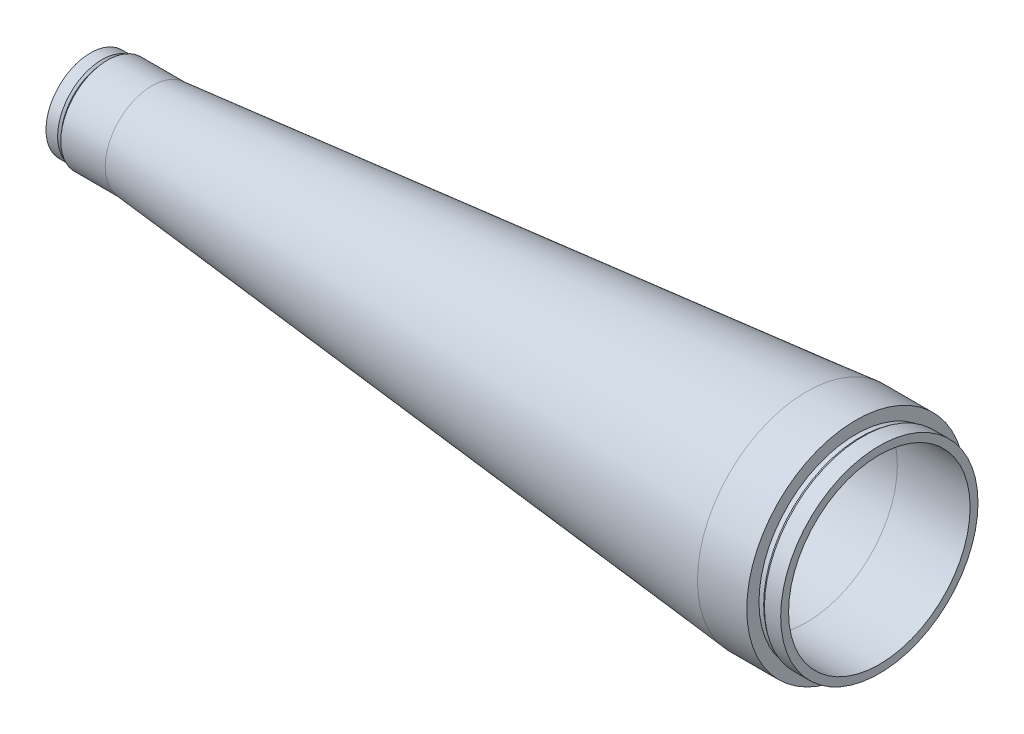
ISO-10303-21;
HEADER;
FILE_DESCRIPTION(('STEP AP214'),'2;1');
FILE_NAME('part.step','',(''),(''),'','','');
FILE_SCHEMA(('AUTOMOTIVE_DESIGN { 1 0 10303 214 1 1 1 1 }'));
ENDSEC;
DATA;
#1=APPLICATION_CONTEXT('core data for automotive mechanical design processes');
#2=APPLICATION_PROTOCOL_DEFINITION('international standard','automotive_design',2000,#1);
#3=PRODUCT_CONTEXT('',#1,'mechanical');
#4=PRODUCT('Part','Part','',(#3));
#5=PRODUCT_RELATED_PRODUCT_CATEGORY('part','',(#4));
#6=PRODUCT_DEFINITION_FORMATION('','',#4);
#7=PRODUCT_DEFINITION_CONTEXT('part definition',#1,'design');
#8=PRODUCT_DEFINITION('design','',#6,#7);
#9=PRODUCT_DEFINITION_SHAPE('','',#8);
#10=(LENGTH_UNIT() NAMED_UNIT(*) SI_UNIT(.MILLI.,.METRE.));
#11=(NAMED_UNIT(*) PLANE_ANGLE_UNIT() SI_UNIT($,.RADIAN.));
#12=(NAMED_UNIT(*) SI_UNIT($,.STERADIAN.) SOLID_ANGLE_UNIT());
#13=UNCERTAINTY_MEASURE_WITH_UNIT(LENGTH_MEASURE(1.E-05),#10,'distance_accuracy_value','');
#14=(GEOMETRIC_REPRESENTATION_CONTEXT(3) GLOBAL_UNCERTAINTY_ASSIGNED_CONTEXT((#13)) GLOBAL_UNIT_ASSIGNED_CONTEXT((#10,
#11,#12)) REPRESENTATION_CONTEXT('',''));
#15=CARTESIAN_POINT('',(0.,0.,0.));
#16=DIRECTION('',(0.,0.,1.));
#17=DIRECTION('',(1.,0.,0.));
#18=AXIS2_PLACEMENT_3D('',#15,#16,#17);
#19=CARTESIAN_POINT('',(-212.632233047034,3.9118014383277E-13,0.));
#20=DIRECTION('',(-1.,0.,0.));
#21=DIRECTION('',(0.,0.,1.));
#22=AXIS2_PLACEMENT_3D('',#19,#20,#21);
#23=CONICAL_SURFACE('',#22,25.5999999999999,0.785398163397451);
#24=CARTESIAN_POINT('',(-213.932233047034,3.97251675998689E-13,0.));
#25=DIRECTION('',(-1.,0.,0.));
#26=DIRECTION('',(0.,0.,1.));
#27=AXIS2_PLACEMENT_3D('',#24,#25,#26);
#28=CIRCLE('',#27,26.8999999999999);
#29=CARTESIAN_POINT('',(-213.932233047034,4.104567986034E-13,26.8999999999999));
#30=VERTEX_POINT('',#29);
#31=EDGE_CURVE('E10',#30,#30,#28,.T.);
#32=ORIENTED_EDGE('',*,*,#31,.T.);
#33=EDGE_LOOP('',(#32));
#34=FACE_BOUND('',#33,.T.);
#35=CARTESIAN_POINT('',(-212.632233047034,3.9118014383277E-13,0.));
#36=DIRECTION('',(-1.,0.,0.));
#37=DIRECTION('',(0.,0.,1.));
#38=AXIS2_PLACEMENT_3D('',#35,#36,#37);
#39=CIRCLE('',#38,25.5999999999999);
#40=CARTESIAN_POINT('',(-212.632233047034,4.03747100661046E-13,25.5999999999999));
#41=VERTEX_POINT('',#40);
#42=EDGE_CURVE('E137',#41,#41,#39,.T.);
#43=ORIENTED_EDGE('',*,*,#42,.F.);
#44=EDGE_LOOP('',(#43));
#45=FACE_BOUND('',#44,.T.);
#46=ADVANCED_FACE('F34',(#34,#45),#23,.F.);
#47=CARTESIAN_POINT('',(-172.442437000996,2.70616862252382E-13,0.));
#48=DIRECTION('',(-1.,0.,0.));
#49=DIRECTION('',(0.,0.,1.));
#50=AXIS2_PLACEMENT_3D('',#47,#48,#49);
#51=CYLINDRICAL_SURFACE('',#50,26.8999999999999);
#52=CARTESIAN_POINT('',(-215.550000000001,3.9118014383277E-13,0.));
#53=DIRECTION('',(-1.,0.,0.));
#54=DIRECTION('',(0.,0.,1.));
#55=AXIS2_PLACEMENT_3D('',#52,#53,#54);
#56=CIRCLE('',#55,26.9);
#57=CARTESIAN_POINT('',(-215.550000000001,4.04385266437482E-13,26.9));
#58=VERTEX_POINT('',#57);
#59=EDGE_CURVE('E40',#58,#58,#56,.T.);
#60=ORIENTED_EDGE('',*,*,#59,.T.);
#61=EDGE_LOOP('',(#60));
#62=FACE_BOUND('',#61,.T.);
#63=ORIENTED_EDGE('',*,*,#31,.F.);
#64=EDGE_LOOP('',(#63));
#65=FACE_BOUND('',#64,.T.);
#66=ADVANCED_FACE('F145',(#62,#65),#51,.F.);
#67=CARTESIAN_POINT('',(-215.550000000001,-25.3999999999997,0.));
#68=DIRECTION('',(1.,0.,0.));
#69=DIRECTION('',(0.,0.,-1.));
#70=AXIS2_PLACEMENT_3D('',#67,#68,#69);
#71=PLANE('',#70);
#72=CARTESIAN_POINT('',(-215.550000000001,3.73832909073002E-13,0.));
#73=DIRECTION('',(-1.,0.,0.));
#74=DIRECTION('',(0.,0.,1.));
#75=AXIS2_PLACEMENT_3D('',#72,#73,#74);
#76=CIRCLE('',#75,25.4);
#77=CARTESIAN_POINT('',(-215.550000000001,3.86301686551057E-13,25.4));
#78=VERTEX_POINT('',#77);
#79=EDGE_CURVE('E44',#78,#78,#76,.T.);
#80=ORIENTED_EDGE('',*,*,#79,.T.);
#81=EDGE_LOOP('',(#80));
#82=FACE_BOUND('',#81,.T.);
#83=ORIENTED_EDGE('',*,*,#59,.F.);
#84=EDGE_LOOP('',(#83));
#85=FACE_BOUND('',#84,.T.);
#86=ADVANCED_FACE('F149',(#82,#85),#71,.T.);
#87=CARTESIAN_POINT('',(-172.442437000996,2.70616862252382E-13,0.));
#88=DIRECTION('',(-1.,0.,0.));
#89=DIRECTION('',(0.,0.,1.));
#90=AXIS2_PLACEMENT_3D('',#87,#88,#89);
#91=CYLINDRICAL_SURFACE('',#90,25.4);
#92=CARTESIAN_POINT('',(-217.050000000001,3.93782229046735E-13,0.));
#93=DIRECTION('',(-1.,0.,0.));
#94=DIRECTION('',(0.,0.,1.));
#95=AXIS2_PLACEMENT_3D('',#92,#93,#94);
#96=CIRCLE('',#95,25.4);
#97=CARTESIAN_POINT('',(-217.050000000001,4.0625100652479E-13,25.4));
#98=VERTEX_POINT('',#97);
#99=EDGE_CURVE('E48',#98,#98,#96,.T.);
#100=ORIENTED_EDGE('',*,*,#99,.T.);
#101=EDGE_LOOP('',(#100));
#102=FACE_BOUND('',#101,.T.);
#103=ORIENTED_EDGE('',*,*,#79,.F.);
#104=EDGE_LOOP('',(#103));
#105=FACE_BOUND('',#104,.T.);
#106=ADVANCED_FACE('F153',(#102,#105),#91,.F.);
#107=CARTESIAN_POINT('',(-217.050000000001,-23.3999999999997,0.));
#108=DIRECTION('',(1.,0.,0.));
#109=DIRECTION('',(0.,0.,-1.));
#110=AXIS2_PLACEMENT_3D('',#107,#108,#109);
#111=PLANE('',#110);
#112=CARTESIAN_POINT('',(-217.050000000001,3.88578058618805E-13,0.));
#113=DIRECTION('',(-1.,0.,0.));
#114=DIRECTION('',(0.,0.,1.));
#115=AXIS2_PLACEMENT_3D('',#112,#113,#114);
#116=CIRCLE('',#115,23.4);
#117=CARTESIAN_POINT('',(-217.050000000001,4.00065042594651E-13,23.4));
#118=VERTEX_POINT('',#117);
#119=EDGE_CURVE('E53',#118,#118,#116,.T.);
#120=ORIENTED_EDGE('',*,*,#119,.T.);
#121=EDGE_LOOP('',(#120));
#122=FACE_BOUND('',#121,.T.);
#123=ORIENTED_EDGE('',*,*,#99,.F.);
#124=EDGE_LOOP('',(#123));
#125=FACE_BOUND('',#124,.T.);
#126=ADVANCED_FACE('F160',(#122,#125),#111,.T.);
#127=CARTESIAN_POINT('',(-217.050000000001,3.88578058618805E-13,0.));
#128=DIRECTION('',(1.,0.,0.));
#129=DIRECTION('',(0.,0.,-1.));
#130=AXIS2_PLACEMENT_3D('',#127,#128,#129);
#131=CONICAL_SURFACE('',#130,23.4,0.099668652491162);
#132=CARTESIAN_POINT('',(-322.050000000001,6.17561557447743E-13,0.));
#133=DIRECTION('',(-1.,0.,0.));
#134=DIRECTION('',(0.,0.,1.));
#135=AXIS2_PLACEMENT_3D('',#132,#133,#134);
#136=CIRCLE('',#135,12.9);
#137=CARTESIAN_POINT('',(-322.050000000001,6.23894125536992E-13,12.9));
#138=VERTEX_POINT('',#137);
#139=EDGE_CURVE('E56',#138,#138,#136,.T.);
#140=ORIENTED_EDGE('',*,*,#139,.T.);
#141=EDGE_LOOP('',(#140));
#142=FACE_BOUND('',#141,.T.);
#143=ORIENTED_EDGE('',*,*,#119,.F.);
#144=EDGE_LOOP('',(#143));
#145=FACE_BOUND('',#144,.T.);
#146=ADVANCED_FACE('F164',(#142,#145),#131,.F.);
#147=CARTESIAN_POINT('',(-322.050000000001,-12.8999999999994,1.70258369571177E-13));
#148=DIRECTION('',(-1.,0.,0.));
#149=DIRECTION('',(0.,0.,1.));
#150=AXIS2_PLACEMENT_3D('',#147,#148,#149);
#151=PLANE('',#150);
#152=CARTESIAN_POINT('',(-322.050000000001,6.17561557447743E-13,0.));
#153=DIRECTION('',(-1.,0.,0.));
#154=DIRECTION('',(0.,0.,1.));
#155=AXIS2_PLACEMENT_3D('',#152,#153,#154);
#156=CIRCLE('',#155,15.4);
#157=CARTESIAN_POINT('',(-322.050000000001,6.25121367414753E-13,15.4));
#158=VERTEX_POINT('',#157);
#159=EDGE_CURVE('E59',#158,#158,#156,.T.);
#160=ORIENTED_EDGE('',*,*,#159,.T.);
#161=EDGE_LOOP('',(#160));
#162=FACE_BOUND('',#161,.T.);
#163=ORIENTED_EDGE('',*,*,#139,.F.);
#164=EDGE_LOOP('',(#163));
#165=FACE_BOUND('',#164,.T.);
#166=ADVANCED_FACE('F168',(#162,#165),#151,.T.);
#167=CARTESIAN_POINT('',(-172.442437000996,2.70616862252382E-13,0.));
#168=DIRECTION('',(-1.,0.,0.));
#169=DIRECTION('',(0.,0.,1.));
#170=AXIS2_PLACEMENT_3D('',#167,#168,#169);
#171=CYLINDRICAL_SURFACE('',#170,15.4);
#172=CARTESIAN_POINT('',(-323.750000000001,7.07767178198537E-13,1.01576182852826E-13));
#173=DIRECTION('',(-1.,0.,0.));
#174=DIRECTION('',(0.,0.,1.));
#175=AXIS2_PLACEMENT_3D('',#172,#173,#174);
#176=CIRCLE('',#175,15.4);
#177=CARTESIAN_POINT('',(-323.750000000001,7.15326988165547E-13,15.4000000000001));
#178=VERTEX_POINT('',#177);
#179=EDGE_CURVE('E62',#178,#178,#176,.T.);
#180=ORIENTED_EDGE('',*,*,#179,.T.);
#181=EDGE_LOOP('',(#180));
#182=FACE_BOUND('',#181,.T.);
#183=ORIENTED_EDGE('',*,*,#159,.F.);
#184=EDGE_LOOP('',(#183));
#185=FACE_BOUND('',#184,.T.);
#186=ADVANCED_FACE('F172',(#182,#185),#171,.F.);
#187=CARTESIAN_POINT('',(-323.750000000001,-15.3999999999994,0.));
#188=DIRECTION('',(-1.,0.,0.));
#189=DIRECTION('',(0.,0.,1.));
#190=AXIS2_PLACEMENT_3D('',#187,#188,#189);
#191=PLANE('',#190);
#192=CARTESIAN_POINT('',(-323.750000000001,7.07767178198537E-13,1.01576182852826E-13));
#193=DIRECTION('',(-1.,0.,0.));
#194=DIRECTION('',(0.,0.,1.));
#195=AXIS2_PLACEMENT_3D('',#192,#193,#194);
#196=CIRCLE('',#195,16.5);
#197=CARTESIAN_POINT('',(-323.750000000001,7.15866974591762E-13,16.5000000000001));
#198=VERTEX_POINT('',#197);
#199=EDGE_CURVE('E65',#198,#198,#196,.T.);
#200=ORIENTED_EDGE('',*,*,#199,.T.);
#201=EDGE_LOOP('',(#200));
#202=FACE_BOUND('',#201,.T.);
#203=ORIENTED_EDGE('',*,*,#179,.F.);
#204=EDGE_LOOP('',(#203));
#205=FACE_BOUND('',#204,.T.);
#206=ADVANCED_FACE('F176',(#202,#205),#191,.T.);
#207=CARTESIAN_POINT('',(-172.442437000996,2.70616862252382E-13,0.));
#208=DIRECTION('',(-1.,0.,0.));
#209=DIRECTION('',(0.,0.,1.));
#210=AXIS2_PLACEMENT_3D('',#207,#208,#209);
#211=CYLINDRICAL_SURFACE('',#210,16.4999999999999);
#212=CARTESIAN_POINT('',(-324.964213562374,6.45317133063372E-13,0.));
#213=DIRECTION('',(-1.,0.,0.));
#214=DIRECTION('',(0.,0.,1.));
#215=AXIS2_PLACEMENT_3D('',#212,#213,#214);
#216=CIRCLE('',#215,16.4999999999999);
#217=CARTESIAN_POINT('',(-324.964213562374,6.53416929456597E-13,16.4999999999999));
#218=VERTEX_POINT('',#217);
#219=EDGE_CURVE('E68',#218,#218,#216,.T.);
#220=ORIENTED_EDGE('',*,*,#219,.T.);
#221=EDGE_LOOP('',(#220));
#222=FACE_BOUND('',#221,.T.);
#223=ORIENTED_EDGE('',*,*,#199,.F.);
#224=EDGE_LOOP('',(#223));
#225=FACE_BOUND('',#224,.T.);
#226=ADVANCED_FACE('F180',(#222,#225),#211,.F.);
#227=CARTESIAN_POINT('',(-324.964213562374,6.45317133063372E-13,0.));
#228=DIRECTION('',(1.,0.,0.));
#229=DIRECTION('',(0.,0.,-1.));
#230=AXIS2_PLACEMENT_3D('',#227,#228,#229);
#231=CONICAL_SURFACE('',#230,16.4999999999999,0.785398163397393);
#232=CARTESIAN_POINT('',(-325.964213562374,6.59194920871187E-13,0.));
#233=DIRECTION('',(-1.,0.,0.));
#234=DIRECTION('',(0.,0.,1.));
#235=AXIS2_PLACEMENT_3D('',#232,#233,#234);
#236=CIRCLE('',#235,15.4999999999999);
#237=CARTESIAN_POINT('',(-325.964213562374,6.66803820513307E-13,15.4999999999999));
#238=VERTEX_POINT('',#237);
#239=EDGE_CURVE('E71',#238,#238,#236,.T.);
#240=ORIENTED_EDGE('',*,*,#239,.T.);
#241=EDGE_LOOP('',(#240));
#242=FACE_BOUND('',#241,.T.);
#243=ORIENTED_EDGE('',*,*,#219,.F.);
#244=EDGE_LOOP('',(#243));
#245=FACE_BOUND('',#244,.T.);
#246=ADVANCED_FACE('F184',(#242,#245),#231,.F.);
#247=CARTESIAN_POINT('',(-172.442437000996,2.70616862252382E-13,0.));
#248=DIRECTION('',(-1.,0.,0.));
#249=DIRECTION('',(0.,0.,1.));
#250=AXIS2_PLACEMENT_3D('',#247,#248,#249);
#251=CYLINDRICAL_SURFACE('',#250,15.5);
#252=CARTESIAN_POINT('',(-347.050000000001,7.07767178198537E-13,0.));
#253=DIRECTION('',(-1.,0.,0.));
#254=DIRECTION('',(0.,0.,1.));
#255=AXIS2_PLACEMENT_3D('',#252,#253,#254);
#256=CIRCLE('',#255,15.5);
#257=CARTESIAN_POINT('',(-347.050000000001,7.15376077840657E-13,15.5000000000001));
#258=VERTEX_POINT('',#257);
#259=EDGE_CURVE('E74',#258,#258,#256,.T.);
#260=ORIENTED_EDGE('',*,*,#259,.T.);
#261=EDGE_LOOP('',(#260));
#262=FACE_BOUND('',#261,.T.);
#263=ORIENTED_EDGE('',*,*,#239,.F.);
#264=EDGE_LOOP('',(#263));
#265=FACE_BOUND('',#264,.T.);
#266=ADVANCED_FACE('F188',(#262,#265),#251,.F.);
#267=CARTESIAN_POINT('',(-347.050000000001,-15.4999999999993,1.01617053864882E-13));
#268=DIRECTION('',(-1.,0.,0.));
#269=DIRECTION('',(0.,0.,1.));
#270=AXIS2_PLACEMENT_3D('',#267,#268,#269);
#271=PLANE('',#270);
#272=CARTESIAN_POINT('',(-347.050000000001,7.07767178198537E-13,0.));
#273=DIRECTION('',(-1.,0.,0.));
#274=DIRECTION('',(0.,0.,1.));
#275=AXIS2_PLACEMENT_3D('',#272,#273,#274);
#276=CIRCLE('',#275,18.);
#277=CARTESIAN_POINT('',(-347.050000000001,7.16603319718419E-13,18.0000000000001));
#278=VERTEX_POINT('',#277);
#279=EDGE_CURVE('E77',#278,#278,#276,.T.);
#280=ORIENTED_EDGE('',*,*,#279,.T.);
#281=EDGE_LOOP('',(#280));
#282=FACE_BOUND('',#281,.T.);
#283=ORIENTED_EDGE('',*,*,#259,.F.);
#284=EDGE_LOOP('',(#283));
#285=FACE_BOUND('',#284,.T.);
#286=ADVANCED_FACE('F192',(#282,#285),#271,.T.);
#287=CARTESIAN_POINT('',(-172.442437000996,2.70616862252382E-13,0.));
#288=DIRECTION('',(-1.,0.,0.));
#289=DIRECTION('',(0.,0.,1.));
#290=AXIS2_PLACEMENT_3D('',#287,#288,#289);
#291=CYLINDRICAL_SURFACE('',#290,18.);
#292=CARTESIAN_POINT('',(-342.350000000001,6.52256026967279E-13,0.));
#293=DIRECTION('',(-1.,0.,0.));
#294=DIRECTION('',(0.,0.,1.));
#295=AXIS2_PLACEMENT_3D('',#292,#293,#294);
#296=CIRCLE('',#295,18.);
#297=CARTESIAN_POINT('',(-342.350000000001,6.61092168487161E-13,18.));
#298=VERTEX_POINT('',#297);
#299=EDGE_CURVE('E80',#298,#298,#296,.T.);
#300=ORIENTED_EDGE('',*,*,#299,.T.);
#301=EDGE_LOOP('',(#300));
#302=FACE_BOUND('',#301,.T.);
#303=ORIENTED_EDGE('',*,*,#279,.F.);
#304=EDGE_LOOP('',(#303));
#305=FACE_BOUND('',#304,.T.);
#306=ADVANCED_FACE('F196',(#302,#305),#291,.T.);
#307=CARTESIAN_POINT('',(-342.350000000001,6.52256026967279E-13,0.));
#308=DIRECTION('',(-1.,0.,0.));
#309=DIRECTION('',(0.,0.,1.));
#310=AXIS2_PLACEMENT_3D('',#307,#308,#309);
#311=CONICAL_SURFACE('',#310,18.,0.718829999621615);
#312=CARTESIAN_POINT('',(-341.550000000001,7.35522753814166E-13,1.09140238163424E-13));
#313=DIRECTION('',(-1.,0.,0.));
#314=DIRECTION('',(0.,0.,1.));
#315=AXIS2_PLACEMENT_3D('',#312,#313,#314);
#316=CIRCLE('',#315,17.3);
#317=CARTESIAN_POINT('',(-341.550000000001,7.44015267608274E-13,17.3000000000001));
#318=VERTEX_POINT('',#317);
#319=EDGE_CURVE('E83',#318,#318,#316,.T.);
#320=ORIENTED_EDGE('',*,*,#319,.T.);
#321=EDGE_LOOP('',(#320));
#322=FACE_BOUND('',#321,.T.);
#323=ORIENTED_EDGE('',*,*,#299,.F.);
#324=EDGE_LOOP('',(#323));
#325=FACE_BOUND('',#324,.T.);
#326=ADVANCED_FACE('F200',(#322,#325),#311,.T.);
#327=CARTESIAN_POINT('',(-172.442437000996,2.70616862252382E-13,0.));
#328=DIRECTION('',(-1.,0.,0.));
#329=DIRECTION('',(0.,0.,1.));
#330=AXIS2_PLACEMENT_3D('',#327,#328,#329);
#331=CYLINDRICAL_SURFACE('',#330,17.3);
#332=CARTESIAN_POINT('',(-340.050000000001,6.52256026967279E-13,0.));
#333=DIRECTION('',(-1.,0.,0.));
#334=DIRECTION('',(0.,0.,1.));
#335=AXIS2_PLACEMENT_3D('',#332,#333,#334);
#336=CIRCLE('',#335,17.3);
#337=CARTESIAN_POINT('',(-340.050000000001,6.60748540761388E-13,17.3000000000001));
#338=VERTEX_POINT('',#337);
#339=EDGE_CURVE('E86',#338,#338,#336,.T.);
#340=ORIENTED_EDGE('',*,*,#339,.T.);
#341=EDGE_LOOP('',(#340));
#342=FACE_BOUND('',#341,.T.);
#343=ORIENTED_EDGE('',*,*,#319,.F.);
#344=EDGE_LOOP('',(#343));
#345=FACE_BOUND('',#344,.T.);
#346=ADVANCED_FACE('F204',(#342,#345),#331,.T.);
#347=CARTESIAN_POINT('',(-340.050000000001,-18.9999999999993,0.));
#348=DIRECTION('',(-1.,0.,0.));
#349=DIRECTION('',(0.,0.,1.));
#350=AXIS2_PLACEMENT_3D('',#347,#348,#349);
#351=PLANE('',#350);
#352=CARTESIAN_POINT('',(-340.050000000001,6.52256026967279E-13,0.));
#353=DIRECTION('',(-1.,0.,0.));
#354=DIRECTION('',(0.,0.,1.));
#355=AXIS2_PLACEMENT_3D('',#352,#353,#354);
#356=CIRCLE('',#355,18.9999999999999);
#357=CARTESIAN_POINT('',(-340.050000000001,6.61583065238265E-13,18.9999999999999));
#358=VERTEX_POINT('',#357);
#359=EDGE_CURVE('E89',#358,#358,#356,.T.);
#360=ORIENTED_EDGE('',*,*,#359,.T.);
#361=EDGE_LOOP('',(#360));
#362=FACE_BOUND('',#361,.T.);
#363=ORIENTED_EDGE('',*,*,#339,.F.);
#364=EDGE_LOOP('',(#363));
#365=FACE_BOUND('',#364,.T.);
#366=ADVANCED_FACE('F208',(#362,#365),#351,.T.);
#367=CARTESIAN_POINT('',(-172.442437000996,2.70616862252382E-13,0.));
#368=DIRECTION('',(-1.,0.,0.));
#369=DIRECTION('',(0.,0.,1.));
#370=AXIS2_PLACEMENT_3D('',#367,#368,#369);
#371=CYLINDRICAL_SURFACE('',#370,18.9999999999999);
#372=CARTESIAN_POINT('',(-322.050000000001,6.17561557447743E-13,0.));
#373=DIRECTION('',(-1.,0.,0.));
#374=DIRECTION('',(0.,0.,1.));
#375=AXIS2_PLACEMENT_3D('',#372,#373,#374);
#376=CIRCLE('',#375,18.9999999999999);
#377=CARTESIAN_POINT('',(-322.050000000001,6.26888595718729E-13,18.9999999999999));
#378=VERTEX_POINT('',#377);
#379=EDGE_CURVE('E92',#378,#378,#376,.T.);
#380=ORIENTED_EDGE('',*,*,#379,.T.);
#381=EDGE_LOOP('',(#380));
#382=FACE_BOUND('',#381,.T.);
#383=ORIENTED_EDGE('',*,*,#359,.F.);
#384=EDGE_LOOP('',(#383));
#385=FACE_BOUND('',#384,.T.);
#386=ADVANCED_FACE('F212',(#382,#385),#371,.T.);
#387=CARTESIAN_POINT('',(-322.050000000001,6.17561557447743E-13,0.));
#388=DIRECTION('',(1.,0.,0.));
#389=DIRECTION('',(0.,0.,-1.));
#390=AXIS2_PLACEMENT_3D('',#387,#388,#389);
#391=CONICAL_SURFACE('',#390,18.9999999999999,0.0948764172599798);
#392=CARTESIAN_POINT('',(-56.7133409365373,0.,0.));
#393=DIRECTION('',(-1.,0.,0.));
#394=DIRECTION('',(0.,0.,1.));
#395=AXIS2_PLACEMENT_3D('',#392,#393,#394);
#396=CIRCLE('',#395,44.2499999999999);
#397=CARTESIAN_POINT('',(-56.7133409365373,0.,44.2499999999998));
#398=VERTEX_POINT('',#397);
#399=EDGE_CURVE('E95',#398,#398,#396,.T.);
#400=ORIENTED_EDGE('',*,*,#399,.T.);
#401=EDGE_LOOP('',(#400));
#402=FACE_BOUND('',#401,.T.);
#403=ORIENTED_EDGE('',*,*,#379,.F.);
#404=EDGE_LOOP('',(#403));
#405=FACE_BOUND('',#404,.T.);
#406=ADVANCED_FACE('F216',(#402,#405),#391,.T.);
#407=CARTESIAN_POINT('',(-172.442437000996,2.70616862252382E-13,0.));
#408=DIRECTION('',(-1.,0.,0.));
#409=DIRECTION('',(0.,0.,1.));
#410=AXIS2_PLACEMENT_3D('',#407,#408,#409);
#411=CYLINDRICAL_SURFACE('',#410,44.2499999999999);
#412=CARTESIAN_POINT('',(-36.7133409365373,0.,0.));
#413=DIRECTION('',(-1.,0.,0.));
#414=DIRECTION('',(0.,0.,1.));
#415=AXIS2_PLACEMENT_3D('',#412,#413,#414);
#416=CIRCLE('',#415,44.2499999999999);
#417=CARTESIAN_POINT('',(-36.7133409365373,0.,44.2499999999998));
#418=VERTEX_POINT('',#417);
#419=EDGE_CURVE('E98',#418,#418,#416,.T.);
#420=ORIENTED_EDGE('',*,*,#419,.T.);
#421=EDGE_LOOP('',(#420));
#422=FACE_BOUND('',#421,.T.);
#423=ORIENTED_EDGE('',*,*,#399,.F.);
#424=EDGE_LOOP('',(#423));
#425=FACE_BOUND('',#424,.T.);
#426=ADVANCED_FACE('F220',(#422,#425),#411,.T.);
#427=CARTESIAN_POINT('',(-36.7133409365369,-39.3,0.));
#428=DIRECTION('',(1.,0.,0.));
#429=DIRECTION('',(0.,0.,-1.));
#430=AXIS2_PLACEMENT_3D('',#427,#428,#429);
#431=PLANE('',#430);
#432=CARTESIAN_POINT('',(-36.7133409365371,0.,-1.09732877526324E-13));
#433=DIRECTION('',(-1.,0.,0.));
#434=DIRECTION('',(0.,0.,1.));
#435=AXIS2_PLACEMENT_3D('',#432,#433,#434);
#436=CIRCLE('',#435,39.2999999999999);
#437=CARTESIAN_POINT('',(-36.7133409365371,0.,39.2999999999997));
#438=VERTEX_POINT('',#437);
#439=EDGE_CURVE('E101',#438,#438,#436,.T.);
#440=ORIENTED_EDGE('',*,*,#439,.T.);
#441=EDGE_LOOP('',(#440));
#442=FACE_BOUND('',#441,.T.);
#443=ORIENTED_EDGE('',*,*,#419,.F.);
#444=EDGE_LOOP('',(#443));
#445=FACE_BOUND('',#444,.T.);
#446=ADVANCED_FACE('F224',(#442,#445),#431,.T.);
#447=CARTESIAN_POINT('',(-172.442437000996,2.70616862252382E-13,0.));
#448=DIRECTION('',(-1.,0.,0.));
#449=DIRECTION('',(0.,0.,1.));
#450=AXIS2_PLACEMENT_3D('',#447,#448,#449);
#451=CYLINDRICAL_SURFACE('',#450,39.2999999999999);
#452=CARTESIAN_POINT('',(-34.8133409365372,0.,-1.09799608238274E-13));
#453=DIRECTION('',(-1.,0.,0.));
#454=DIRECTION('',(0.,0.,1.));
#455=AXIS2_PLACEMENT_3D('',#452,#453,#454);
#456=CIRCLE('',#455,39.2999999999999);
#457=CARTESIAN_POINT('',(-34.8133409365373,0.,39.2999999999997));
#458=VERTEX_POINT('',#457);
#459=EDGE_CURVE('E104',#458,#458,#456,.T.);
#460=ORIENTED_EDGE('',*,*,#459,.T.);
#461=EDGE_LOOP('',(#460));
#462=FACE_BOUND('',#461,.T.);
#463=ORIENTED_EDGE('',*,*,#439,.F.);
#464=EDGE_LOOP('',(#463));
#465=FACE_BOUND('',#464,.T.);
#466=ADVANCED_FACE('F228',(#462,#465),#451,.T.);
#467=CARTESIAN_POINT('',(-34.8133409365372,0.,-1.09799608238274E-13));
#468=DIRECTION('',(1.,0.,0.));
#469=DIRECTION('',(0.,0.,-1.));
#470=AXIS2_PLACEMENT_3D('',#467,#468,#469);
#471=CONICAL_SURFACE('',#470,39.2999999999999,0.610725964389143);
#472=CARTESIAN_POINT('',(-33.8133409365369,-1.38777878078145E-13,0.));
#473=DIRECTION('',(-1.,0.,0.));
#474=DIRECTION('',(0.,0.,1.));
#475=AXIS2_PLACEMENT_3D('',#472,#473,#474);
#476=CIRCLE('',#475,39.9999999999999);
#477=CARTESIAN_POINT('',(-33.8133409365369,-1.19142008033964E-13,39.9999999999999));
#478=VERTEX_POINT('',#477);
#479=EDGE_CURVE('E107',#478,#478,#476,.T.);
#480=ORIENTED_EDGE('',*,*,#479,.T.);
#481=EDGE_LOOP('',(#480));
#482=FACE_BOUND('',#481,.T.);
#483=ORIENTED_EDGE('',*,*,#459,.F.);
#484=EDGE_LOOP('',(#483));
#485=FACE_BOUND('',#484,.T.);
#486=ADVANCED_FACE('F232',(#482,#485),#471,.T.);
#487=CARTESIAN_POINT('',(-172.442437000996,2.70616862252382E-13,0.));
#488=DIRECTION('',(-1.,0.,0.));
#489=DIRECTION('',(0.,0.,1.));
#490=AXIS2_PLACEMENT_3D('',#487,#488,#489);
#491=CYLINDRICAL_SURFACE('',#490,39.9999999999999);
#492=CARTESIAN_POINT('',(-27.213340936537,0.,-1.23944318893889E-13));
#493=DIRECTION('',(-1.,0.,0.));
#494=DIRECTION('',(0.,0.,1.));
#495=AXIS2_PLACEMENT_3D('',#492,#493,#494);
#496=CIRCLE('',#495,39.9999999999999);
#497=CARTESIAN_POINT('',(-27.2133409365371,0.,39.9999999999997));
#498=VERTEX_POINT('',#497);
#499=EDGE_CURVE('E110',#498,#498,#496,.T.);
#500=ORIENTED_EDGE('',*,*,#499,.T.);
#501=EDGE_LOOP('',(#500));
#502=FACE_BOUND('',#501,.T.);
#503=ORIENTED_EDGE('',*,*,#479,.F.);
#504=EDGE_LOOP('',(#503));
#505=FACE_BOUND('',#504,.T.);
#506=ADVANCED_FACE('F236',(#502,#505),#491,.T.);
#507=CARTESIAN_POINT('',(-27.213340936537,-36.8000000000001,-1.18851261339441E-13));
#508=DIRECTION('',(1.,0.,0.));
#509=DIRECTION('',(0.,0.,-1.));
#510=AXIS2_PLACEMENT_3D('',#507,#508,#509);
#511=PLANE('',#510);
#512=CARTESIAN_POINT('',(-27.2133409365371,0.,-1.23944318893889E-13));
#513=DIRECTION('',(-1.,0.,0.));
#514=DIRECTION('',(0.,0.,1.));
#515=AXIS2_PLACEMENT_3D('',#512,#513,#514);
#516=CIRCLE('',#515,36.7999999999999);
#517=CARTESIAN_POINT('',(-27.2133409365371,0.,36.7999999999997));
#518=VERTEX_POINT('',#517);
#519=EDGE_CURVE('E113',#518,#518,#516,.T.);
#520=ORIENTED_EDGE('',*,*,#519,.T.);
#521=EDGE_LOOP('',(#520));
#522=FACE_BOUND('',#521,.T.);
#523=ORIENTED_EDGE('',*,*,#499,.F.);
#524=EDGE_LOOP('',(#523));
#525=FACE_BOUND('',#524,.T.);
#526=ADVANCED_FACE('F240',(#522,#525),#511,.T.);
#527=CARTESIAN_POINT('',(-172.442437000996,2.70616862252382E-13,0.));
#528=DIRECTION('',(-1.,0.,0.));
#529=DIRECTION('',(0.,0.,1.));
#530=AXIS2_PLACEMENT_3D('',#527,#528,#529);
#531=CYLINDRICAL_SURFACE('',#530,36.7999999999999);
#532=CARTESIAN_POINT('',(-56.7133409365373,0.,0.));
#533=DIRECTION('',(-1.,0.,0.));
#534=DIRECTION('',(0.,0.,1.));
#535=AXIS2_PLACEMENT_3D('',#532,#533,#534);
#536=CIRCLE('',#535,36.7999999999999);
#537=CARTESIAN_POINT('',(-56.7133409365373,0.,36.7999999999998));
#538=VERTEX_POINT('',#537);
#539=EDGE_CURVE('E116',#538,#538,#536,.T.);
#540=ORIENTED_EDGE('',*,*,#539,.T.);
#541=EDGE_LOOP('',(#540));
#542=FACE_BOUND('',#541,.T.);
#543=ORIENTED_EDGE('',*,*,#519,.F.);
#544=EDGE_LOOP('',(#543));
#545=FACE_BOUND('',#544,.T.);
#546=ADVANCED_FACE('F244',(#542,#545),#531,.F.);
#547=CARTESIAN_POINT('',(-56.7133409365373,0.,0.));
#548=DIRECTION('',(1.,0.,0.));
#549=DIRECTION('',(0.,0.,-1.));
#550=AXIS2_PLACEMENT_3D('',#547,#548,#549);
#551=CONICAL_SURFACE('',#550,36.7999999999999,0.0610865238198041);
#552=CARTESIAN_POINT('',(-112.09968441265,1.2490009027033E-13,0.));
#553=DIRECTION('',(-1.,0.,0.));
#554=DIRECTION('',(0.,0.,1.));
#555=AXIS2_PLACEMENT_3D('',#552,#553,#554);
#556=CIRCLE('',#555,33.412426112446);
#557=CARTESIAN_POINT('',(-112.09968441265,1.4130214169545E-13,33.412426112446));
#558=VERTEX_POINT('',#557);
#559=EDGE_CURVE('E119',#558,#558,#556,.T.);
#560=ORIENTED_EDGE('',*,*,#559,.T.);
#561=EDGE_LOOP('',(#560));
#562=FACE_BOUND('',#561,.T.);
#563=ORIENTED_EDGE('',*,*,#539,.F.);
#564=EDGE_LOOP('',(#563));
#565=FACE_BOUND('',#564,.T.);
#566=ADVANCED_FACE('F248',(#562,#565),#551,.F.);
#567=CARTESIAN_POINT('',(-112.09968441265,1.2490009027033E-13,0.));
#568=DIRECTION('',(-1.,0.,0.));
#569=DIRECTION('',(0.,0.,1.));
#570=AXIS2_PLACEMENT_3D('',#567,#568,#569);
#571=CONICAL_SURFACE('',#570,33.412426112446,0.785398163397448);
#572=CARTESIAN_POINT('',(-113.187258300203,1.52655665885959E-13,0.));
#573=DIRECTION('',(-1.,0.,0.));
#574=DIRECTION('',(0.,0.,1.));
#575=AXIS2_PLACEMENT_3D('',#572,#573,#574);
#576=CIRCLE('',#575,34.4999999999999);
#577=CARTESIAN_POINT('',(-113.187258300203,1.69591603799065E-13,34.4999999999999));
#578=VERTEX_POINT('',#577);
#579=EDGE_CURVE('E122',#578,#578,#576,.T.);
#580=ORIENTED_EDGE('',*,*,#579,.T.);
#581=EDGE_LOOP('',(#580));
#582=FACE_BOUND('',#581,.T.);
#583=ORIENTED_EDGE('',*,*,#559,.F.);
#584=EDGE_LOOP('',(#583));
#585=FACE_BOUND('',#584,.T.);
#586=ADVANCED_FACE('F252',(#582,#585),#571,.F.);
#587=CARTESIAN_POINT('',(-172.442437000996,2.70616862252382E-13,0.));
#588=DIRECTION('',(-1.,0.,0.));
#589=DIRECTION('',(0.,0.,1.));
#590=AXIS2_PLACEMENT_3D('',#587,#588,#589);
#591=CYLINDRICAL_SURFACE('',#590,34.4999999999999);
#592=CARTESIAN_POINT('',(-115.55,1.11022302462516E-13,0.));
#593=DIRECTION('',(-1.,0.,0.));
#594=DIRECTION('',(0.,0.,1.));
#595=AXIS2_PLACEMENT_3D('',#592,#593,#594);
#596=CIRCLE('',#595,34.5);
#597=CARTESIAN_POINT('',(-115.55,1.27958240375622E-13,34.5));
#598=VERTEX_POINT('',#597);
#599=EDGE_CURVE('E125',#598,#598,#596,.T.);
#600=ORIENTED_EDGE('',*,*,#599,.T.);
#601=EDGE_LOOP('',(#600));
#602=FACE_BOUND('',#601,.T.);
#603=ORIENTED_EDGE('',*,*,#579,.F.);
#604=EDGE_LOOP('',(#603));
#605=FACE_BOUND('',#604,.T.);
#606=ADVANCED_FACE('F256',(#602,#605),#591,.F.);
#607=CARTESIAN_POINT('',(-115.55,-33.4,0.));
#608=DIRECTION('',(1.,0.,0.));
#609=DIRECTION('',(0.,0.,-1.));
#610=AXIS2_PLACEMENT_3D('',#607,#608,#609);
#611=PLANE('',#610);
#612=CARTESIAN_POINT('',(-115.55,1.11022302462516E-13,0.));
#613=DIRECTION('',(-1.,0.,0.));
#614=DIRECTION('',(0.,0.,1.));
#615=AXIS2_PLACEMENT_3D('',#612,#613,#614);
#616=CIRCLE('',#615,33.4);
#617=CARTESIAN_POINT('',(-115.55,1.27418253949407E-13,33.4));
#618=VERTEX_POINT('',#617);
#619=EDGE_CURVE('E128',#618,#618,#616,.T.);
#620=ORIENTED_EDGE('',*,*,#619,.T.);
#621=EDGE_LOOP('',(#620));
#622=FACE_BOUND('',#621,.T.);
#623=ORIENTED_EDGE('',*,*,#599,.F.);
#624=EDGE_LOOP('',(#623));
#625=FACE_BOUND('',#624,.T.);
#626=ADVANCED_FACE('F260',(#622,#625),#611,.T.);
#627=CARTESIAN_POINT('',(-172.442437000996,2.70616862252382E-13,0.));
#628=DIRECTION('',(-1.,0.,0.));
#629=DIRECTION('',(0.,0.,1.));
#630=AXIS2_PLACEMENT_3D('',#627,#628,#629);
#631=CYLINDRICAL_SURFACE('',#630,33.4);
#632=CARTESIAN_POINT('',(-117.05,1.80411241501588E-13,0.));
#633=DIRECTION('',(-1.,0.,0.));
#634=DIRECTION('',(0.,0.,1.));
#635=AXIS2_PLACEMENT_3D('',#632,#633,#634);
#636=CIRCLE('',#635,33.4);
#637=CARTESIAN_POINT('',(-117.05,1.96807192988479E-13,33.4));
#638=VERTEX_POINT('',#637);
#639=EDGE_CURVE('E131',#638,#638,#636,.T.);
#640=ORIENTED_EDGE('',*,*,#639,.T.);
#641=EDGE_LOOP('',(#640));
#642=FACE_BOUND('',#641,.T.);
#643=ORIENTED_EDGE('',*,*,#619,.F.);
#644=EDGE_LOOP('',(#643));
#645=FACE_BOUND('',#644,.T.);
#646=ADVANCED_FACE('F264',(#642,#645),#631,.F.);
#647=CARTESIAN_POINT('',(-117.05,-29.4,0.));
#648=DIRECTION('',(1.,0.,0.));
#649=DIRECTION('',(0.,0.,-1.));
#650=AXIS2_PLACEMENT_3D('',#647,#648,#649);
#651=PLANE('',#650);
#652=CARTESIAN_POINT('',(-117.05,1.80411241501588E-13,0.));
#653=DIRECTION('',(-1.,0.,0.));
#654=DIRECTION('',(0.,0.,1.));
#655=AXIS2_PLACEMENT_3D('',#652,#653,#654);
#656=CIRCLE('',#655,29.4);
#657=CARTESIAN_POINT('',(-117.05,1.94843605984061E-13,29.4));
#658=VERTEX_POINT('',#657);
#659=EDGE_CURVE('E134',#658,#658,#656,.T.);
#660=ORIENTED_EDGE('',*,*,#659,.T.);
#661=EDGE_LOOP('',(#660));
#662=FACE_BOUND('',#661,.T.);
#663=ORIENTED_EDGE('',*,*,#639,.F.);
#664=EDGE_LOOP('',(#663));
#665=FACE_BOUND('',#664,.T.);
#666=ADVANCED_FACE('F268',(#662,#665),#651,.T.);
#667=CARTESIAN_POINT('',(-117.05,1.80411241501588E-13,0.));
#668=DIRECTION('',(1.,0.,0.));
#669=DIRECTION('',(0.,0.,-1.));
#670=AXIS2_PLACEMENT_3D('',#667,#668,#669);
#671=CONICAL_SURFACE('',#670,29.4,0.0397354165534999);
#672=ORIENTED_EDGE('',*,*,#42,.T.);
#673=EDGE_LOOP('',(#672));
#674=FACE_BOUND('',#673,.T.);
#675=ORIENTED_EDGE('',*,*,#659,.F.);
#676=EDGE_LOOP('',(#675));
#677=FACE_BOUND('',#676,.T.);
#678=ADVANCED_FACE('F141',(#674,#677),#671,.F.);
#679=CLOSED_SHELL('',(#46,#66,#86,#106,#126,#146,#166,#186,#206,#226,#246,#266,#286,#306,#326,
#346,#366,#386,#406,#426,#446,#466,#486,#506,#526,#546,#566,#586,#606,#626,#646,#666,#678));
#680=MANIFOLD_SOLID_BREP('B2',#679);
#681=ADVANCED_BREP_SHAPE_REPRESENTATION('',(#18,#680),#14);
#682=SHAPE_DEFINITION_REPRESENTATION(#9,#681);
ENDSEC;
END-ISO-10303-21;
